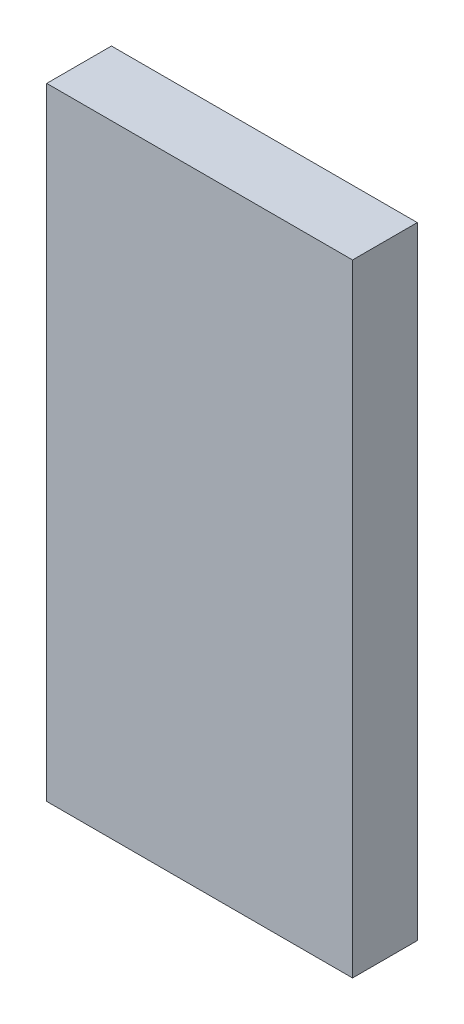
ISO-10303-21;
HEADER;
FILE_DESCRIPTION(('STEP AP214'),'2;1');
FILE_NAME('part.step','',(''),(''),'','','');
FILE_SCHEMA(('AUTOMOTIVE_DESIGN { 1 0 10303 214 1 1 1 1 }'));
ENDSEC;
DATA;
#1=APPLICATION_CONTEXT('core data for automotive mechanical design processes');
#2=APPLICATION_PROTOCOL_DEFINITION('international standard','automotive_design',2000,#1);
#3=PRODUCT_CONTEXT('',#1,'mechanical');
#4=PRODUCT('Part','Part','',(#3));
#5=PRODUCT_RELATED_PRODUCT_CATEGORY('part','',(#4));
#6=PRODUCT_DEFINITION_FORMATION('','',#4);
#7=PRODUCT_DEFINITION_CONTEXT('part definition',#1,'design');
#8=PRODUCT_DEFINITION('design','',#6,#7);
#9=PRODUCT_DEFINITION_SHAPE('','',#8);
#10=(LENGTH_UNIT() NAMED_UNIT(*) SI_UNIT(.MILLI.,.METRE.));
#11=(NAMED_UNIT(*) PLANE_ANGLE_UNIT() SI_UNIT($,.RADIAN.));
#12=(NAMED_UNIT(*) SI_UNIT($,.STERADIAN.) SOLID_ANGLE_UNIT());
#13=UNCERTAINTY_MEASURE_WITH_UNIT(LENGTH_MEASURE(1.E-05),#10,'distance_accuracy_value','');
#14=(GEOMETRIC_REPRESENTATION_CONTEXT(3) GLOBAL_UNCERTAINTY_ASSIGNED_CONTEXT((#13)) GLOBAL_UNIT_ASSIGNED_CONTEXT((#10,
#11,#12)) REPRESENTATION_CONTEXT('',''));
#15=CARTESIAN_POINT('',(0.,0.,0.));
#16=DIRECTION('',(0.,0.,1.));
#17=DIRECTION('',(1.,0.,0.));
#18=AXIS2_PLACEMENT_3D('',#15,#16,#17);
#19=CARTESIAN_POINT('',(0.,0.,6.35));
#20=DIRECTION('',(1.,0.,0.));
#21=DIRECTION('',(0.,1.,0.));
#22=AXIS2_PLACEMENT_3D('',#19,#20,#21);
#23=PLANE('',#22);
#24=DIRECTION('',(0.,-1.,0.));
#25=VECTOR('',#24,1.);
#26=CARTESIAN_POINT('',(0.,0.,0.));
#27=LINE('',#26,#25);
#28=CARTESIAN_POINT('',(0.,61.,0.));
#29=VERTEX_POINT('',#28);
#30=CARTESIAN_POINT('',(0.,0.,0.));
#31=VERTEX_POINT('',#30);
#32=EDGE_CURVE('E96',#29,#31,#27,.T.);
#33=ORIENTED_EDGE('',*,*,#32,.T.);
#34=DIRECTION('',(0.,0.,-1.));
#35=VECTOR('',#34,1.);
#36=CARTESIAN_POINT('',(0.,0.,6.35));
#37=LINE('',#36,#35);
#38=CARTESIAN_POINT('',(0.,0.,6.35));
#39=VERTEX_POINT('',#38);
#40=EDGE_CURVE('E11',#39,#31,#37,.T.);
#41=ORIENTED_EDGE('',*,*,#40,.F.);
#42=DIRECTION('',(0.,-1.,0.));
#43=VECTOR('',#42,1.);
#44=CARTESIAN_POINT('',(0.,0.,6.35));
#45=LINE('',#44,#43);
#46=CARTESIAN_POINT('',(0.,61.,6.35));
#47=VERTEX_POINT('',#46);
#48=EDGE_CURVE('E84',#47,#39,#45,.T.);
#49=ORIENTED_EDGE('',*,*,#48,.F.);
#50=DIRECTION('',(0.,0.,-1.));
#51=VECTOR('',#50,1.);
#52=CARTESIAN_POINT('',(0.,61.,6.35));
#53=LINE('',#52,#51);
#54=EDGE_CURVE('E92',#47,#29,#53,.T.);
#55=ORIENTED_EDGE('',*,*,#54,.T.);
#56=EDGE_LOOP('',(#33,#41,#49,#55));
#57=FACE_BOUND('',#56,.T.);
#58=ADVANCED_FACE('F33',(#57),#23,.F.);
#59=CARTESIAN_POINT('',(0.,0.,6.35));
#60=DIRECTION('',(0.,1.,0.));
#61=DIRECTION('',(0.,0.,1.));
#62=AXIS2_PLACEMENT_3D('',#59,#60,#61);
#63=PLANE('',#62);
#64=DIRECTION('',(1.,0.,0.));
#65=VECTOR('',#64,1.);
#66=CARTESIAN_POINT('',(0.,0.,0.));
#67=LINE('',#66,#65);
#68=CARTESIAN_POINT('',(30.,0.,0.));
#69=VERTEX_POINT('',#68);
#70=EDGE_CURVE('E88',#31,#69,#67,.T.);
#71=ORIENTED_EDGE('',*,*,#70,.T.);
#72=DIRECTION('',(0.,0.,-1.));
#73=VECTOR('',#72,1.);
#74=CARTESIAN_POINT('',(30.,0.,6.35));
#75=LINE('',#74,#73);
#76=CARTESIAN_POINT('',(30.,0.,6.35));
#77=VERTEX_POINT('',#76);
#78=EDGE_CURVE('E41',#77,#69,#75,.T.);
#79=ORIENTED_EDGE('',*,*,#78,.F.);
#80=DIRECTION('',(1.,0.,0.));
#81=VECTOR('',#80,1.);
#82=CARTESIAN_POINT('',(0.,0.,6.35));
#83=LINE('',#82,#81);
#84=EDGE_CURVE('E79',#39,#77,#83,.T.);
#85=ORIENTED_EDGE('',*,*,#84,.F.);
#86=ORIENTED_EDGE('',*,*,#40,.T.);
#87=EDGE_LOOP('',(#71,#79,#85,#86));
#88=FACE_BOUND('',#87,.T.);
#89=ADVANCED_FACE('F87',(#88),#63,.F.);
#90=CARTESIAN_POINT('',(30.,0.,6.35));
#91=DIRECTION('',(-1.,0.,0.));
#92=DIRECTION('',(0.,-1.,0.));
#93=AXIS2_PLACEMENT_3D('',#90,#91,#92);
#94=PLANE('',#93);
#95=DIRECTION('',(0.,1.,0.));
#96=VECTOR('',#95,1.);
#97=CARTESIAN_POINT('',(30.,0.,0.));
#98=LINE('',#97,#96);
#99=CARTESIAN_POINT('',(30.,61.,0.));
#100=VERTEX_POINT('',#99);
#101=EDGE_CURVE('E66',#69,#100,#98,.T.);
#102=ORIENTED_EDGE('',*,*,#101,.T.);
#103=DIRECTION('',(0.,0.,-1.));
#104=VECTOR('',#103,1.);
#105=CARTESIAN_POINT('',(30.,61.,6.35));
#106=LINE('',#105,#104);
#107=CARTESIAN_POINT('',(30.,61.,6.35));
#108=VERTEX_POINT('',#107);
#109=EDGE_CURVE('E89',#108,#100,#106,.T.);
#110=ORIENTED_EDGE('',*,*,#109,.F.);
#111=DIRECTION('',(0.,1.,0.));
#112=VECTOR('',#111,1.);
#113=CARTESIAN_POINT('',(30.,0.,6.35));
#114=LINE('',#113,#112);
#115=EDGE_CURVE('E82',#77,#108,#114,.T.);
#116=ORIENTED_EDGE('',*,*,#115,.F.);
#117=ORIENTED_EDGE('',*,*,#78,.T.);
#118=EDGE_LOOP('',(#102,#110,#116,#117));
#119=FACE_BOUND('',#118,.T.);
#120=ADVANCED_FACE('F90',(#119),#94,.F.);
#121=CARTESIAN_POINT('',(0.,61.,6.35));
#122=DIRECTION('',(0.,-1.,0.));
#123=DIRECTION('',(0.,0.,-1.));
#124=AXIS2_PLACEMENT_3D('',#121,#122,#123);
#125=PLANE('',#124);
#126=DIRECTION('',(-1.,0.,0.));
#127=VECTOR('',#126,1.);
#128=CARTESIAN_POINT('',(0.,61.,0.));
#129=LINE('',#128,#127);
#130=EDGE_CURVE('E72',#100,#29,#129,.T.);
#131=ORIENTED_EDGE('',*,*,#130,.T.);
#132=ORIENTED_EDGE('',*,*,#54,.F.);
#133=DIRECTION('',(-1.,0.,0.));
#134=VECTOR('',#133,1.);
#135=CARTESIAN_POINT('',(0.,61.,6.35));
#136=LINE('',#135,#134);
#137=EDGE_CURVE('E49',#108,#47,#136,.T.);
#138=ORIENTED_EDGE('',*,*,#137,.F.);
#139=ORIENTED_EDGE('',*,*,#109,.T.);
#140=EDGE_LOOP('',(#131,#132,#138,#139));
#141=FACE_BOUND('',#140,.T.);
#142=ADVANCED_FACE('F103',(#141),#125,.F.);
#143=CARTESIAN_POINT('',(0.,61.,6.35));
#144=DIRECTION('',(0.,0.,-1.));
#145=DIRECTION('',(-1.,0.,0.));
#146=AXIS2_PLACEMENT_3D('',#143,#144,#145);
#147=PLANE('',#146);
#148=ORIENTED_EDGE('',*,*,#48,.T.);
#149=ORIENTED_EDGE('',*,*,#84,.T.);
#150=ORIENTED_EDGE('',*,*,#115,.T.);
#151=ORIENTED_EDGE('',*,*,#137,.T.);
#152=EDGE_LOOP('',(#148,#149,#150,#151));
#153=FACE_BOUND('',#152,.T.);
#154=ADVANCED_FACE('F80',(#153),#147,.F.);
#155=CARTESIAN_POINT('',(0.,61.,0.));
#156=DIRECTION('',(0.,0.,-1.));
#157=DIRECTION('',(-1.,0.,0.));
#158=AXIS2_PLACEMENT_3D('',#155,#156,#157);
#159=PLANE('',#158);
#160=ORIENTED_EDGE('',*,*,#32,.F.);
#161=ORIENTED_EDGE('',*,*,#130,.F.);
#162=ORIENTED_EDGE('',*,*,#101,.F.);
#163=ORIENTED_EDGE('',*,*,#70,.F.);
#164=EDGE_LOOP('',(#160,#161,#162,#163));
#165=FACE_BOUND('',#164,.T.);
#166=ADVANCED_FACE('F106',(#165),#159,.T.);
#167=CLOSED_SHELL('',(#58,#89,#120,#142,#154,#166));
#168=MANIFOLD_SOLID_BREP('B2',#167);
#169=ADVANCED_BREP_SHAPE_REPRESENTATION('',(#18,#168),#14);
#170=SHAPE_DEFINITION_REPRESENTATION(#9,#169);
ENDSEC;
END-ISO-10303-21;
